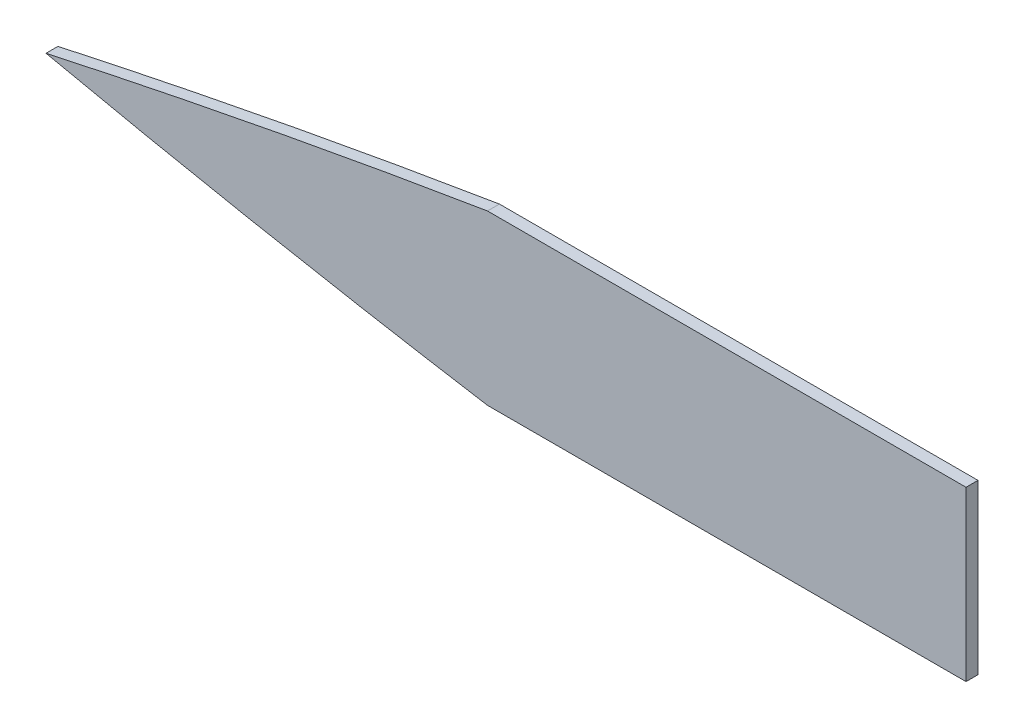
ISO-10303-21;
HEADER;
FILE_DESCRIPTION(('STEP AP214'),'2;1');
FILE_NAME('part.step','',(''),(''),'','','');
FILE_SCHEMA(('AUTOMOTIVE_DESIGN { 1 0 10303 214 1 1 1 1 }'));
ENDSEC;
DATA;
#1=APPLICATION_CONTEXT('core data for automotive mechanical design processes');
#2=APPLICATION_PROTOCOL_DEFINITION('international standard','automotive_design',2000,#1);
#3=PRODUCT_CONTEXT('',#1,'mechanical');
#4=PRODUCT('Part','Part','',(#3));
#5=PRODUCT_RELATED_PRODUCT_CATEGORY('part','',(#4));
#6=PRODUCT_DEFINITION_FORMATION('','',#4);
#7=PRODUCT_DEFINITION_CONTEXT('part definition',#1,'design');
#8=PRODUCT_DEFINITION('design','',#6,#7);
#9=PRODUCT_DEFINITION_SHAPE('','',#8);
#10=(LENGTH_UNIT() NAMED_UNIT(*) SI_UNIT(.MILLI.,.METRE.));
#11=(NAMED_UNIT(*) PLANE_ANGLE_UNIT() SI_UNIT($,.RADIAN.));
#12=(NAMED_UNIT(*) SI_UNIT($,.STERADIAN.) SOLID_ANGLE_UNIT());
#13=UNCERTAINTY_MEASURE_WITH_UNIT(LENGTH_MEASURE(1.E-05),#10,'distance_accuracy_value','');
#14=(GEOMETRIC_REPRESENTATION_CONTEXT(3) GLOBAL_UNCERTAINTY_ASSIGNED_CONTEXT((#13)) GLOBAL_UNIT_ASSIGNED_CONTEXT((#10,
#11,#12)) REPRESENTATION_CONTEXT('',''));
#15=CARTESIAN_POINT('',(0.,0.,0.));
#16=DIRECTION('',(0.,0.,1.));
#17=DIRECTION('',(1.,0.,0.));
#18=AXIS2_PLACEMENT_3D('',#15,#16,#17);
#19=CARTESIAN_POINT('',(6.25338747538251,0.,-1.25));
#20=CARTESIAN_POINT('',(52.1488444110375,-9.97539250897919,-1.25));
#21=CARTESIAN_POINT('',(98.5028912664369,-17.5887651040598,-1.25));
#22=B_SPLINE_CURVE_WITH_KNOTS('',2,(#19,#20,#21),.UNSPECIFIED.,.F.,.F.,(3,3),(0.,1.),.UNSPECIFIED.);
#23=DIRECTION('',(0.,0.,1.));
#24=VECTOR('',#23,1.);
#25=SURFACE_OF_LINEAR_EXTRUSION('',#22,#24);
#26=DIRECTION('',(0.,0.,1.));
#27=VECTOR('',#26,1.);
#28=CARTESIAN_POINT('',(98.5028912664369,-17.5887651040598,-1.25));
#29=LINE('',#28,#27);
#30=CARTESIAN_POINT('',(98.5028912664369,-17.5887651040598,-1.25));
#31=VERTEX_POINT('',#30);
#32=CARTESIAN_POINT('',(98.5028912664369,-17.5887651040598,1.25));
#33=VERTEX_POINT('',#32);
#34=EDGE_CURVE('E37',#31,#33,#29,.T.);
#35=ORIENTED_EDGE('',*,*,#34,.T.);
#36=CARTESIAN_POINT('',(6.25338747538251,0.,1.25));
#37=CARTESIAN_POINT('',(52.1488444110375,-9.97539250897919,1.25));
#38=CARTESIAN_POINT('',(98.5028912664369,-17.5887651040598,1.25));
#39=B_SPLINE_CURVE_WITH_KNOTS('',2,(#36,#37,#38),.UNSPECIFIED.,.F.,.F.,(3,3),(0.,1.),.UNSPECIFIED.);
#40=CARTESIAN_POINT('',(6.25338747538251,0.,1.25));
#41=VERTEX_POINT('',#40);
#42=EDGE_CURVE('E80',#41,#33,#39,.T.);
#43=ORIENTED_EDGE('',*,*,#42,.F.);
#44=DIRECTION('',(0.,0.,1.));
#45=VECTOR('',#44,1.);
#46=CARTESIAN_POINT('',(6.25338747538251,0.,-1.25));
#47=LINE('',#46,#45);
#48=CARTESIAN_POINT('',(6.25338747538251,0.,-1.25));
#49=VERTEX_POINT('',#48);
#50=EDGE_CURVE('E11',#49,#41,#47,.T.);
#51=ORIENTED_EDGE('',*,*,#50,.F.);
#52=EDGE_CURVE('E81',#49,#31,#22,.T.);
#53=ORIENTED_EDGE('',*,*,#52,.T.);
#54=EDGE_LOOP('',(#35,#43,#51,#53));
#55=FACE_BOUND('',#54,.T.);
#56=ADVANCED_FACE('F33',(#55),#25,.T.);
#57=CARTESIAN_POINT('',(98.5028912664369,17.5887651040598,-1.25));
#58=CARTESIAN_POINT('',(52.1488444110375,9.9753925089792,-1.25));
#59=CARTESIAN_POINT('',(6.25338747538251,0.,-1.25));
#60=B_SPLINE_CURVE_WITH_KNOTS('',2,(#57,#58,#59),.UNSPECIFIED.,.F.,.F.,(3,3),(0.,1.),.UNSPECIFIED.);
#61=DIRECTION('',(0.,0.,1.));
#62=VECTOR('',#61,1.);
#63=SURFACE_OF_LINEAR_EXTRUSION('',#60,#62);
#64=ORIENTED_EDGE('',*,*,#50,.T.);
#65=CARTESIAN_POINT('',(98.5028912664369,17.5887651040598,1.25));
#66=CARTESIAN_POINT('',(52.1488444110375,9.9753925089792,1.25));
#67=CARTESIAN_POINT('',(6.25338747538251,0.,1.25));
#68=B_SPLINE_CURVE_WITH_KNOTS('',2,(#65,#66,#67),.UNSPECIFIED.,.F.,.F.,(3,3),(0.,1.),.UNSPECIFIED.);
#69=CARTESIAN_POINT('',(98.5028912664369,17.5887651040598,1.25));
#70=VERTEX_POINT('',#69);
#71=EDGE_CURVE('E98',#70,#41,#68,.T.);
#72=ORIENTED_EDGE('',*,*,#71,.F.);
#73=DIRECTION('',(0.,0.,1.));
#74=VECTOR('',#73,1.);
#75=CARTESIAN_POINT('',(98.5028912664369,17.5887651040598,-1.25));
#76=LINE('',#75,#74);
#77=CARTESIAN_POINT('',(98.5028912664369,17.5887651040598,-1.25));
#78=VERTEX_POINT('',#77);
#79=EDGE_CURVE('E42',#78,#70,#76,.T.);
#80=ORIENTED_EDGE('',*,*,#79,.F.);
#81=EDGE_CURVE('E86',#78,#49,#60,.T.);
#82=ORIENTED_EDGE('',*,*,#81,.T.);
#83=EDGE_LOOP('',(#64,#72,#80,#82));
#84=FACE_BOUND('',#83,.T.);
#85=ADVANCED_FACE('F136',(#84),#63,.T.);
#86=CARTESIAN_POINT('',(98.5028912664369,17.5887651040598,-1.25));
#87=DIRECTION('',(0.,1.,0.));
#88=DIRECTION('',(0.,0.,1.));
#89=AXIS2_PLACEMENT_3D('',#86,#87,#88);
#90=PLANE('',#89);
#91=ORIENTED_EDGE('',*,*,#79,.T.);
#92=DIRECTION('',(-1.,0.,0.));
#93=VECTOR('',#92,1.);
#94=CARTESIAN_POINT('',(98.5028912664369,17.5887651040598,1.25));
#95=LINE('',#94,#93);
#96=CARTESIAN_POINT('',(198.502891266437,17.5887651040598,1.25));
#97=VERTEX_POINT('',#96);
#98=EDGE_CURVE('E107',#97,#70,#95,.T.);
#99=ORIENTED_EDGE('',*,*,#98,.F.);
#100=DIRECTION('',(0.,0.,1.));
#101=VECTOR('',#100,1.);
#102=CARTESIAN_POINT('',(198.502891266437,17.5887651040598,-1.25));
#103=LINE('',#102,#101);
#104=CARTESIAN_POINT('',(198.502891266437,17.5887651040598,-1.25));
#105=VERTEX_POINT('',#104);
#106=EDGE_CURVE('E199',#105,#97,#103,.T.);
#107=ORIENTED_EDGE('',*,*,#106,.F.);
#108=DIRECTION('',(-1.,0.,0.));
#109=VECTOR('',#108,1.);
#110=CARTESIAN_POINT('',(98.5028912664369,17.5887651040598,-1.25));
#111=LINE('',#110,#109);
#112=EDGE_CURVE('E126',#105,#78,#111,.T.);
#113=ORIENTED_EDGE('',*,*,#112,.T.);
#114=EDGE_LOOP('',(#91,#99,#107,#113));
#115=FACE_BOUND('',#114,.T.);
#116=ADVANCED_FACE('F140',(#115),#90,.T.);
#117=CARTESIAN_POINT('',(198.502891266437,-17.5887651040598,-1.25));
#118=DIRECTION('',(1.,0.,0.));
#119=DIRECTION('',(0.,0.,-1.));
#120=AXIS2_PLACEMENT_3D('',#117,#118,#119);
#121=PLANE('',#120);
#122=ORIENTED_EDGE('',*,*,#106,.T.);
#123=DIRECTION('',(0.,1.,0.));
#124=VECTOR('',#123,1.);
#125=CARTESIAN_POINT('',(198.502891266437,-17.5887651040598,1.25));
#126=LINE('',#125,#124);
#127=CARTESIAN_POINT('',(198.502891266437,-17.5887651040598,1.25));
#128=VERTEX_POINT('',#127);
#129=EDGE_CURVE('E93',#128,#97,#126,.T.);
#130=ORIENTED_EDGE('',*,*,#129,.F.);
#131=DIRECTION('',(0.,0.,1.));
#132=VECTOR('',#131,1.);
#133=CARTESIAN_POINT('',(198.502891266437,-17.5887651040598,-1.25));
#134=LINE('',#133,#132);
#135=CARTESIAN_POINT('',(198.502891266437,-17.5887651040598,-1.25));
#136=VERTEX_POINT('',#135);
#137=EDGE_CURVE('E85',#136,#128,#134,.T.);
#138=ORIENTED_EDGE('',*,*,#137,.F.);
#139=DIRECTION('',(0.,1.,0.));
#140=VECTOR('',#139,1.);
#141=CARTESIAN_POINT('',(198.502891266437,-17.5887651040598,-1.25));
#142=LINE('',#141,#140);
#143=EDGE_CURVE('E123',#136,#105,#142,.T.);
#144=ORIENTED_EDGE('',*,*,#143,.T.);
#145=EDGE_LOOP('',(#122,#130,#138,#144));
#146=FACE_BOUND('',#145,.T.);
#147=ADVANCED_FACE('F145',(#146),#121,.T.);
#148=CARTESIAN_POINT('',(98.5028912664369,-17.5887651040598,-1.25));
#149=DIRECTION('',(0.,-1.,0.));
#150=DIRECTION('',(0.,0.,-1.));
#151=AXIS2_PLACEMENT_3D('',#148,#149,#150);
#152=PLANE('',#151);
#153=ORIENTED_EDGE('',*,*,#137,.T.);
#154=DIRECTION('',(1.,0.,0.));
#155=VECTOR('',#154,1.);
#156=CARTESIAN_POINT('',(98.5028912664369,-17.5887651040598,1.25));
#157=LINE('',#156,#155);
#158=EDGE_CURVE('E88',#33,#128,#157,.T.);
#159=ORIENTED_EDGE('',*,*,#158,.F.);
#160=ORIENTED_EDGE('',*,*,#34,.F.);
#161=DIRECTION('',(1.,0.,0.));
#162=VECTOR('',#161,1.);
#163=CARTESIAN_POINT('',(98.5028912664369,-17.5887651040598,-1.25));
#164=LINE('',#163,#162);
#165=EDGE_CURVE('E118',#31,#136,#164,.T.);
#166=ORIENTED_EDGE('',*,*,#165,.T.);
#167=EDGE_LOOP('',(#153,#159,#160,#166));
#168=FACE_BOUND('',#167,.T.);
#169=ADVANCED_FACE('F89',(#168),#152,.T.);
#170=CARTESIAN_POINT('',(52.2634918909736,-9.38488753050454,-1.25));
#171=DIRECTION('',(0.,0.,-1.));
#172=DIRECTION('',(-1.,0.,0.));
#173=AXIS2_PLACEMENT_3D('',#170,#171,#172);
#174=PLANE('',#173);
#175=ORIENTED_EDGE('',*,*,#52,.F.);
#176=ORIENTED_EDGE('',*,*,#81,.F.);
#177=ORIENTED_EDGE('',*,*,#112,.F.);
#178=ORIENTED_EDGE('',*,*,#143,.F.);
#179=ORIENTED_EDGE('',*,*,#165,.F.);
#180=EDGE_LOOP('',(#175,#176,#177,#178,#179));
#181=FACE_BOUND('',#180,.T.);
#182=ADVANCED_FACE('F141',(#181),#174,.T.);
#183=CARTESIAN_POINT('',(52.2634918909736,-9.38488753050454,1.25));
#184=DIRECTION('',(0.,0.,-1.));
#185=DIRECTION('',(-1.,0.,0.));
#186=AXIS2_PLACEMENT_3D('',#183,#184,#185);
#187=PLANE('',#186);
#188=ORIENTED_EDGE('',*,*,#42,.T.);
#189=ORIENTED_EDGE('',*,*,#158,.T.);
#190=ORIENTED_EDGE('',*,*,#129,.T.);
#191=ORIENTED_EDGE('',*,*,#98,.T.);
#192=ORIENTED_EDGE('',*,*,#71,.T.);
#193=EDGE_LOOP('',(#188,#189,#190,#191,#192));
#194=FACE_BOUND('',#193,.T.);
#195=ADVANCED_FACE('F96',(#194),#187,.F.);
#196=CLOSED_SHELL('',(#56,#85,#116,#147,#169,#182,#195));
#197=MANIFOLD_SOLID_BREP('B2',#196);
#198=ADVANCED_BREP_SHAPE_REPRESENTATION('',(#18,#197),#14);
#199=SHAPE_DEFINITION_REPRESENTATION(#9,#198);
ENDSEC;
END-ISO-10303-21;
